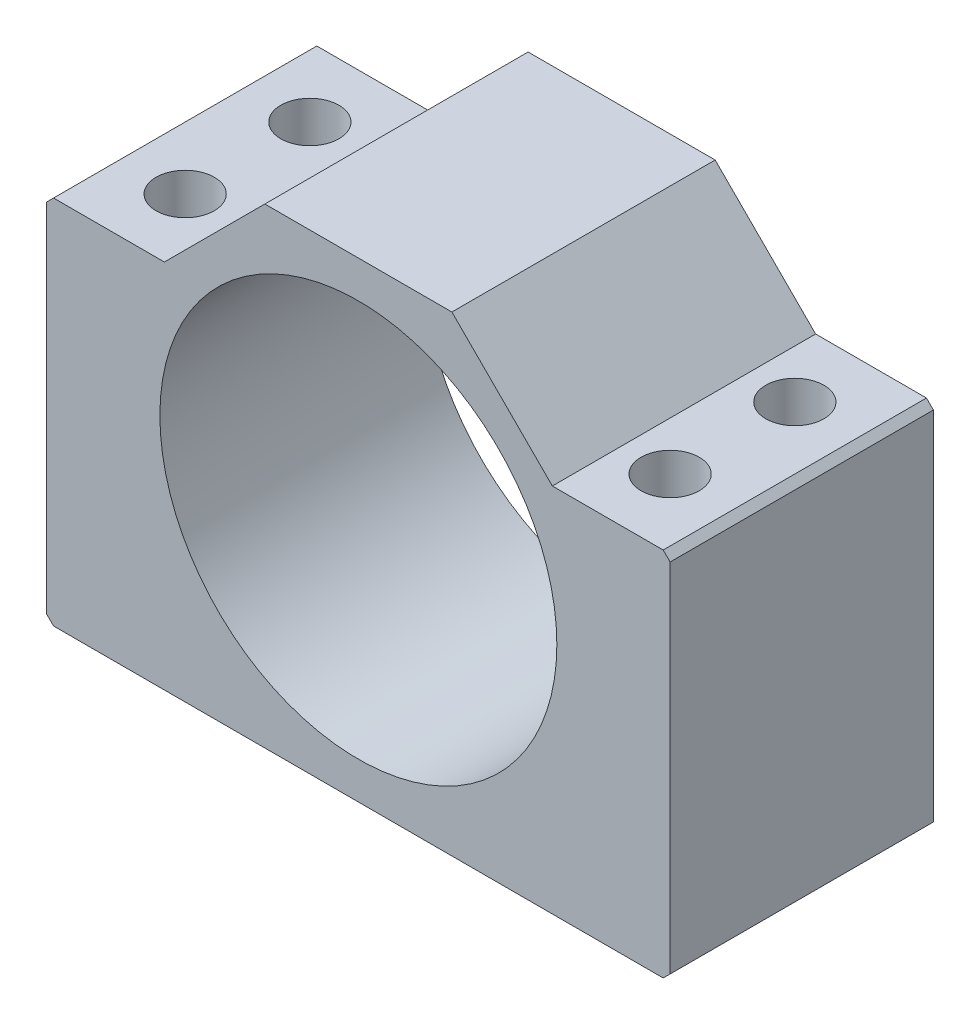
ISO-10303-21;
HEADER;
FILE_DESCRIPTION(('STEP AP214'),'2;1');
FILE_NAME('part.step','',(''),(''),'','','');
FILE_SCHEMA(('AUTOMOTIVE_DESIGN { 1 0 10303 214 1 1 1 1 }'));
ENDSEC;
DATA;
#1=APPLICATION_CONTEXT('core data for automotive mechanical design processes');
#2=APPLICATION_PROTOCOL_DEFINITION('international standard','automotive_design',2000,#1);
#3=PRODUCT_CONTEXT('',#1,'mechanical');
#4=PRODUCT('Part','Part','',(#3));
#5=PRODUCT_RELATED_PRODUCT_CATEGORY('part','',(#4));
#6=PRODUCT_DEFINITION_FORMATION('','',#4);
#7=PRODUCT_DEFINITION_CONTEXT('part definition',#1,'design');
#8=PRODUCT_DEFINITION('design','',#6,#7);
#9=PRODUCT_DEFINITION_SHAPE('','',#8);
#10=(LENGTH_UNIT() NAMED_UNIT(*) SI_UNIT(.MILLI.,.METRE.));
#11=(NAMED_UNIT(*) PLANE_ANGLE_UNIT() SI_UNIT($,.RADIAN.));
#12=(NAMED_UNIT(*) SI_UNIT($,.STERADIAN.) SOLID_ANGLE_UNIT());
#13=UNCERTAINTY_MEASURE_WITH_UNIT(LENGTH_MEASURE(1.E-05),#10,'distance_accuracy_value','');
#14=(GEOMETRIC_REPRESENTATION_CONTEXT(3) GLOBAL_UNCERTAINTY_ASSIGNED_CONTEXT((#13)) GLOBAL_UNIT_ASSIGNED_CONTEXT((#10,
#11,#12)) REPRESENTATION_CONTEXT('',''));
#15=CARTESIAN_POINT('',(0.,0.,0.));
#16=DIRECTION('',(0.,0.,1.));
#17=DIRECTION('',(1.,0.,0.));
#18=AXIS2_PLACEMENT_3D('',#15,#16,#17);
#19=CARTESIAN_POINT('',(0.,0.,19.));
#20=DIRECTION('',(0.,0.,-1.));
#21=DIRECTION('',(-1.,0.,0.));
#22=AXIS2_PLACEMENT_3D('',#19,#20,#21);
#23=PLANE('',#22);
#24=DIRECTION('',(1.,0.,0.));
#25=VECTOR('',#24,1.);
#26=CARTESIAN_POINT('',(-45.,-34.,19.));
#27=LINE('',#26,#25);
#28=CARTESIAN_POINT('',(-44.,-34.,19.));
#29=VERTEX_POINT('',#28);
#30=CARTESIAN_POINT('',(44.,-34.,19.));
#31=VERTEX_POINT('',#30);
#32=EDGE_CURVE('E203',#29,#31,#27,.T.);
#33=ORIENTED_EDGE('',*,*,#32,.T.);
#34=DIRECTION('',(-0.707106781186548,-0.707106781186548,0.));
#35=VECTOR('',#34,1.);
#36=CARTESIAN_POINT('',(45.,-33.,19.));
#37=LINE('',#36,#35);
#38=CARTESIAN_POINT('',(45.,-33.,19.));
#39=VERTEX_POINT('',#38);
#40=EDGE_CURVE('E241',#31,#39,#37,.F.);
#41=ORIENTED_EDGE('',*,*,#40,.T.);
#42=DIRECTION('',(0.,1.,0.));
#43=VECTOR('',#42,1.);
#44=CARTESIAN_POINT('',(45.,-34.,19.));
#45=LINE('',#44,#43);
#46=CARTESIAN_POINT('',(45.,18.5,19.));
#47=VERTEX_POINT('',#46);
#48=EDGE_CURVE('E195',#39,#47,#45,.T.);
#49=ORIENTED_EDGE('',*,*,#48,.T.);
#50=DIRECTION('',(0.707106781186548,-0.707106781186548,0.));
#51=VECTOR('',#50,1.);
#52=CARTESIAN_POINT('',(45.,18.5,19.));
#53=LINE('',#52,#51);
#54=CARTESIAN_POINT('',(44.,19.5,19.));
#55=VERTEX_POINT('',#54);
#56=EDGE_CURVE('E236',#47,#55,#53,.F.);
#57=ORIENTED_EDGE('',*,*,#56,.T.);
#58=DIRECTION('',(1.,0.,0.));
#59=VECTOR('',#58,1.);
#60=CARTESIAN_POINT('',(45.,19.5,19.));
#61=LINE('',#60,#59);
#62=CARTESIAN_POINT('',(28.0000000000004,19.5,19.));
#63=VERTEX_POINT('',#62);
#64=EDGE_CURVE('E148',#63,#55,#61,.T.);
#65=ORIENTED_EDGE('',*,*,#64,.F.);
#66=DIRECTION('',(0.707106781186556,-0.707106781186538,0.));
#67=VECTOR('',#66,1.);
#68=CARTESIAN_POINT('',(28.0000000000004,19.5,19.));
#69=LINE('',#68,#67);
#70=CARTESIAN_POINT('',(13.5,34.,19.));
#71=VERTEX_POINT('',#70);
#72=EDGE_CURVE('E127',#71,#63,#69,.T.);
#73=ORIENTED_EDGE('',*,*,#72,.F.);
#74=DIRECTION('',(-1.,0.,0.));
#75=VECTOR('',#74,1.);
#76=CARTESIAN_POINT('',(-45.,34.,19.));
#77=LINE('',#76,#75);
#78=CARTESIAN_POINT('',(-13.5,34.,19.));
#79=VERTEX_POINT('',#78);
#80=EDGE_CURVE('E198',#71,#79,#77,.T.);
#81=ORIENTED_EDGE('',*,*,#80,.T.);
#82=DIRECTION('',(0.707106781186546,0.707106781186549,0.));
#83=VECTOR('',#82,1.);
#84=CARTESIAN_POINT('',(-28.,19.5,19.));
#85=LINE('',#84,#83);
#86=CARTESIAN_POINT('',(-28.,19.5,19.));
#87=VERTEX_POINT('',#86);
#88=EDGE_CURVE('E161',#87,#79,#85,.T.);
#89=ORIENTED_EDGE('',*,*,#88,.F.);
#90=DIRECTION('',(1.,0.,0.));
#91=VECTOR('',#90,1.);
#92=CARTESIAN_POINT('',(-45.,19.5,19.));
#93=LINE('',#92,#91);
#94=CARTESIAN_POINT('',(-44.,19.5,19.));
#95=VERTEX_POINT('',#94);
#96=EDGE_CURVE('E157',#95,#87,#93,.T.);
#97=ORIENTED_EDGE('',*,*,#96,.F.);
#98=DIRECTION('',(0.707106781186548,0.707106781186548,0.));
#99=VECTOR('',#98,1.);
#100=CARTESIAN_POINT('',(-44.,19.5,19.));
#101=LINE('',#100,#99);
#102=CARTESIAN_POINT('',(-45.,18.5,19.));
#103=VERTEX_POINT('',#102);
#104=EDGE_CURVE('E54',#95,#103,#101,.F.);
#105=ORIENTED_EDGE('',*,*,#104,.T.);
#106=DIRECTION('',(0.,-1.,0.));
#107=VECTOR('',#106,1.);
#108=CARTESIAN_POINT('',(-45.,-34.,19.));
#109=LINE('',#108,#107);
#110=CARTESIAN_POINT('',(-45.,-33.,19.));
#111=VERTEX_POINT('',#110);
#112=EDGE_CURVE('E201',#103,#111,#109,.T.);
#113=ORIENTED_EDGE('',*,*,#112,.T.);
#114=DIRECTION('',(-0.707106781186548,0.707106781186548,0.));
#115=VECTOR('',#114,1.);
#116=CARTESIAN_POINT('',(-44.,-34.,19.));
#117=LINE('',#116,#115);
#118=EDGE_CURVE('E239',#111,#29,#117,.F.);
#119=ORIENTED_EDGE('',*,*,#118,.T.);
#120=EDGE_LOOP('',(#33,#41,#49,#57,#65,#73,#81,#89,#97,#105,#113,#119));
#121=FACE_BOUND('',#120,.T.);
#122=CARTESIAN_POINT('',(0.,0.,19.));
#123=DIRECTION('',(0.,0.,1.));
#124=DIRECTION('',(1.,0.,0.));
#125=AXIS2_PLACEMENT_3D('',#122,#123,#124);
#126=CIRCLE('',#125,28.65);
#127=CARTESIAN_POINT('',(28.65,0.,19.));
#128=VERTEX_POINT('',#127);
#129=EDGE_CURVE('E189',#128,#128,#126,.T.);
#130=ORIENTED_EDGE('',*,*,#129,.F.);
#131=EDGE_LOOP('',(#130));
#132=FACE_BOUND('',#131,.T.);
#133=ADVANCED_FACE('F32',(#121,#132),#23,.F.);
#134=CARTESIAN_POINT('',(0.,0.,-19.));
#135=DIRECTION('',(0.,0.,-1.));
#136=DIRECTION('',(-1.,0.,0.));
#137=AXIS2_PLACEMENT_3D('',#134,#135,#136);
#138=PLANE('',#137);
#139=DIRECTION('',(0.,1.,0.));
#140=VECTOR('',#139,1.);
#141=CARTESIAN_POINT('',(45.,-34.,-19.));
#142=LINE('',#141,#140);
#143=CARTESIAN_POINT('',(45.,-33.,-19.));
#144=VERTEX_POINT('',#143);
#145=CARTESIAN_POINT('',(45.,18.5,-19.));
#146=VERTEX_POINT('',#145);
#147=EDGE_CURVE('E192',#144,#146,#142,.T.);
#148=ORIENTED_EDGE('',*,*,#147,.F.);
#149=DIRECTION('',(0.707106781186548,0.707106781186548,0.));
#150=VECTOR('',#149,1.);
#151=CARTESIAN_POINT('',(39.,-39.,-19.));
#152=LINE('',#151,#150);
#153=CARTESIAN_POINT('',(44.,-34.,-19.));
#154=VERTEX_POINT('',#153);
#155=EDGE_CURVE('E229',#144,#154,#152,.F.);
#156=ORIENTED_EDGE('',*,*,#155,.T.);
#157=DIRECTION('',(1.,0.,0.));
#158=VECTOR('',#157,1.);
#159=CARTESIAN_POINT('',(-45.,-34.,-19.));
#160=LINE('',#159,#158);
#161=CARTESIAN_POINT('',(-44.,-34.,-19.));
#162=VERTEX_POINT('',#161);
#163=EDGE_CURVE('E199',#162,#154,#160,.T.);
#164=ORIENTED_EDGE('',*,*,#163,.F.);
#165=DIRECTION('',(0.707106781186548,-0.707106781186548,0.));
#166=VECTOR('',#165,1.);
#167=CARTESIAN_POINT('',(-39.,-39.,-19.));
#168=LINE('',#167,#166);
#169=CARTESIAN_POINT('',(-45.,-33.,-19.));
#170=VERTEX_POINT('',#169);
#171=EDGE_CURVE('E227',#162,#170,#168,.F.);
#172=ORIENTED_EDGE('',*,*,#171,.T.);
#173=DIRECTION('',(0.,-1.,0.));
#174=VECTOR('',#173,1.);
#175=CARTESIAN_POINT('',(-45.,-34.,-19.));
#176=LINE('',#175,#174);
#177=CARTESIAN_POINT('',(-45.,18.5,-19.));
#178=VERTEX_POINT('',#177);
#179=EDGE_CURVE('E210',#178,#170,#176,.T.);
#180=ORIENTED_EDGE('',*,*,#179,.F.);
#181=DIRECTION('',(-0.707106781186548,-0.707106781186548,0.));
#182=VECTOR('',#181,1.);
#183=CARTESIAN_POINT('',(-31.75,31.75,-19.));
#184=LINE('',#183,#182);
#185=CARTESIAN_POINT('',(-44.,19.5,-19.));
#186=VERTEX_POINT('',#185);
#187=EDGE_CURVE('E225',#178,#186,#184,.F.);
#188=ORIENTED_EDGE('',*,*,#187,.T.);
#189=DIRECTION('',(1.,0.,0.));
#190=VECTOR('',#189,1.);
#191=CARTESIAN_POINT('',(-45.,19.5,-19.));
#192=LINE('',#191,#190);
#193=CARTESIAN_POINT('',(-28.,19.5,-19.));
#194=VERTEX_POINT('',#193);
#195=EDGE_CURVE('E158',#186,#194,#192,.T.);
#196=ORIENTED_EDGE('',*,*,#195,.T.);
#197=DIRECTION('',(0.707106781186546,0.707106781186549,0.));
#198=VECTOR('',#197,1.);
#199=CARTESIAN_POINT('',(-28.,19.5,-19.));
#200=LINE('',#199,#198);
#201=CARTESIAN_POINT('',(-13.5,34.,-19.));
#202=VERTEX_POINT('',#201);
#203=EDGE_CURVE('E160',#194,#202,#200,.T.);
#204=ORIENTED_EDGE('',*,*,#203,.T.);
#205=DIRECTION('',(-1.,0.,0.));
#206=VECTOR('',#205,1.);
#207=CARTESIAN_POINT('',(-45.,34.,-19.));
#208=LINE('',#207,#206);
#209=CARTESIAN_POINT('',(13.5,34.,-19.));
#210=VERTEX_POINT('',#209);
#211=EDGE_CURVE('E147',#210,#202,#208,.T.);
#212=ORIENTED_EDGE('',*,*,#211,.F.);
#213=DIRECTION('',(0.707106781186556,-0.707106781186538,0.));
#214=VECTOR('',#213,1.);
#215=CARTESIAN_POINT('',(28.0000000000004,19.5,-19.));
#216=LINE('',#215,#214);
#217=CARTESIAN_POINT('',(28.0000000000004,19.5,-19.));
#218=VERTEX_POINT('',#217);
#219=EDGE_CURVE('E124',#210,#218,#216,.T.);
#220=ORIENTED_EDGE('',*,*,#219,.T.);
#221=DIRECTION('',(1.,0.,0.));
#222=VECTOR('',#221,1.);
#223=CARTESIAN_POINT('',(45.,19.5,-19.));
#224=LINE('',#223,#222);
#225=CARTESIAN_POINT('',(44.,19.5,-19.));
#226=VERTEX_POINT('',#225);
#227=EDGE_CURVE('E135',#218,#226,#224,.T.);
#228=ORIENTED_EDGE('',*,*,#227,.T.);
#229=DIRECTION('',(-0.707106781186548,0.707106781186548,0.));
#230=VECTOR('',#229,1.);
#231=CARTESIAN_POINT('',(31.75,31.75,-19.));
#232=LINE('',#231,#230);
#233=EDGE_CURVE('E223',#226,#146,#232,.F.);
#234=ORIENTED_EDGE('',*,*,#233,.T.);
#235=EDGE_LOOP('',(#148,#156,#164,#172,#180,#188,#196,#204,#212,#220,#228,#234));
#236=FACE_BOUND('',#235,.T.);
#237=CARTESIAN_POINT('',(0.,0.,-19.));
#238=DIRECTION('',(0.,0.,1.));
#239=DIRECTION('',(1.,0.,0.));
#240=AXIS2_PLACEMENT_3D('',#237,#238,#239);
#241=CIRCLE('',#240,28.65);
#242=CARTESIAN_POINT('',(28.65,0.,-19.));
#243=VERTEX_POINT('',#242);
#244=EDGE_CURVE('E188',#243,#243,#241,.T.);
#245=ORIENTED_EDGE('',*,*,#244,.T.);
#246=EDGE_LOOP('',(#245));
#247=FACE_BOUND('',#246,.T.);
#248=ADVANCED_FACE('F144',(#236,#247),#138,.T.);
#249=CARTESIAN_POINT('',(45.,-34.,19.));
#250=DIRECTION('',(-1.,0.,0.));
#251=DIRECTION('',(0.,0.,1.));
#252=AXIS2_PLACEMENT_3D('',#249,#250,#251);
#253=PLANE('',#252);
#254=ORIENTED_EDGE('',*,*,#48,.F.);
#255=DIRECTION('',(0.,0.,-1.));
#256=VECTOR('',#255,1.);
#257=CARTESIAN_POINT('',(45.,-33.,19.));
#258=LINE('',#257,#256);
#259=EDGE_CURVE('E220',#39,#144,#258,.T.);
#260=ORIENTED_EDGE('',*,*,#259,.T.);
#261=ORIENTED_EDGE('',*,*,#147,.T.);
#262=DIRECTION('',(0.,0.,1.));
#263=VECTOR('',#262,1.);
#264=CARTESIAN_POINT('',(45.,18.5,19.));
#265=LINE('',#264,#263);
#266=EDGE_CURVE('E206',#146,#47,#265,.T.);
#267=ORIENTED_EDGE('',*,*,#266,.T.);
#268=EDGE_LOOP('',(#254,#260,#261,#267));
#269=FACE_BOUND('',#268,.T.);
#270=ADVANCED_FACE('F267',(#269),#253,.F.);
#271=CARTESIAN_POINT('',(-45.,34.,19.));
#272=DIRECTION('',(0.,-1.,0.));
#273=DIRECTION('',(0.,0.,-1.));
#274=AXIS2_PLACEMENT_3D('',#271,#272,#273);
#275=PLANE('',#274);
#276=ORIENTED_EDGE('',*,*,#80,.F.);
#277=DIRECTION('',(0.,0.,1.));
#278=VECTOR('',#277,1.);
#279=CARTESIAN_POINT('',(13.5,34.,-19.));
#280=LINE('',#279,#278);
#281=EDGE_CURVE('E132',#210,#71,#280,.T.);
#282=ORIENTED_EDGE('',*,*,#281,.F.);
#283=ORIENTED_EDGE('',*,*,#211,.T.);
#284=DIRECTION('',(0.,0.,1.));
#285=VECTOR('',#284,1.);
#286=CARTESIAN_POINT('',(-13.5,34.,-19.));
#287=LINE('',#286,#285);
#288=EDGE_CURVE('E167',#202,#79,#287,.T.);
#289=ORIENTED_EDGE('',*,*,#288,.T.);
#290=EDGE_LOOP('',(#276,#282,#283,#289));
#291=FACE_BOUND('',#290,.T.);
#292=ADVANCED_FACE('F262',(#291),#275,.F.);
#293=CARTESIAN_POINT('',(-45.,-34.,19.));
#294=DIRECTION('',(1.,0.,0.));
#295=DIRECTION('',(0.,0.,-1.));
#296=AXIS2_PLACEMENT_3D('',#293,#294,#295);
#297=PLANE('',#296);
#298=ORIENTED_EDGE('',*,*,#179,.T.);
#299=DIRECTION('',(0.,0.,1.));
#300=VECTOR('',#299,1.);
#301=CARTESIAN_POINT('',(-45.,-33.,19.));
#302=LINE('',#301,#300);
#303=EDGE_CURVE('E47',#170,#111,#302,.T.);
#304=ORIENTED_EDGE('',*,*,#303,.T.);
#305=ORIENTED_EDGE('',*,*,#112,.F.);
#306=DIRECTION('',(0.,0.,-1.));
#307=VECTOR('',#306,1.);
#308=CARTESIAN_POINT('',(-45.,18.5,19.));
#309=LINE('',#308,#307);
#310=EDGE_CURVE('E243',#103,#178,#309,.T.);
#311=ORIENTED_EDGE('',*,*,#310,.T.);
#312=EDGE_LOOP('',(#298,#304,#305,#311));
#313=FACE_BOUND('',#312,.T.);
#314=ADVANCED_FACE('F282',(#313),#297,.F.);
#315=CARTESIAN_POINT('',(-45.,-34.,19.));
#316=DIRECTION('',(0.,1.,0.));
#317=DIRECTION('',(0.,0.,1.));
#318=AXIS2_PLACEMENT_3D('',#315,#316,#317);
#319=PLANE('',#318);
#320=CARTESIAN_POINT('',(-35.,-34.,-9.));
#321=DIRECTION('',(0.,1.,0.));
#322=DIRECTION('',(0.,0.,1.));
#323=AXIS2_PLACEMENT_3D('',#320,#321,#322);
#324=CIRCLE('',#323,4.19999999999999);
#325=CARTESIAN_POINT('',(-35.,-34.,-4.80000000000001));
#326=VERTEX_POINT('',#325);
#327=EDGE_CURVE('E176',#326,#326,#324,.T.);
#328=ORIENTED_EDGE('',*,*,#327,.T.);
#329=EDGE_LOOP('',(#328));
#330=FACE_BOUND('',#329,.T.);
#331=CARTESIAN_POINT('',(-35.,-34.,9.));
#332=DIRECTION('',(0.,1.,0.));
#333=DIRECTION('',(0.,0.,1.));
#334=AXIS2_PLACEMENT_3D('',#331,#332,#333);
#335=CIRCLE('',#334,4.19999999999999);
#336=CARTESIAN_POINT('',(-35.,-34.,13.2));
#337=VERTEX_POINT('',#336);
#338=EDGE_CURVE('E179',#337,#337,#335,.T.);
#339=ORIENTED_EDGE('',*,*,#338,.T.);
#340=EDGE_LOOP('',(#339));
#341=FACE_BOUND('',#340,.T.);
#342=CARTESIAN_POINT('',(35.,-34.,9.));
#343=DIRECTION('',(0.,1.,0.));
#344=DIRECTION('',(0.,0.,1.));
#345=AXIS2_PLACEMENT_3D('',#342,#343,#344);
#346=CIRCLE('',#345,4.2);
#347=CARTESIAN_POINT('',(35.,-34.,13.2));
#348=VERTEX_POINT('',#347);
#349=EDGE_CURVE('E182',#348,#348,#346,.T.);
#350=ORIENTED_EDGE('',*,*,#349,.T.);
#351=EDGE_LOOP('',(#350));
#352=FACE_BOUND('',#351,.T.);
#353=CARTESIAN_POINT('',(35.,-34.,-9.));
#354=DIRECTION('',(0.,1.,0.));
#355=DIRECTION('',(0.,0.,1.));
#356=AXIS2_PLACEMENT_3D('',#353,#354,#355);
#357=CIRCLE('',#356,4.2);
#358=CARTESIAN_POINT('',(35.,-34.,-4.8));
#359=VERTEX_POINT('',#358);
#360=EDGE_CURVE('E185',#359,#359,#357,.T.);
#361=ORIENTED_EDGE('',*,*,#360,.T.);
#362=EDGE_LOOP('',(#361));
#363=FACE_BOUND('',#362,.T.);
#364=ORIENTED_EDGE('',*,*,#163,.T.);
#365=DIRECTION('',(0.,0.,1.));
#366=VECTOR('',#365,1.);
#367=CARTESIAN_POINT('',(44.,-34.,19.));
#368=LINE('',#367,#366);
#369=EDGE_CURVE('E234',#154,#31,#368,.T.);
#370=ORIENTED_EDGE('',*,*,#369,.T.);
#371=ORIENTED_EDGE('',*,*,#32,.F.);
#372=DIRECTION('',(0.,0.,-1.));
#373=VECTOR('',#372,1.);
#374=CARTESIAN_POINT('',(-44.,-34.,19.));
#375=LINE('',#374,#373);
#376=EDGE_CURVE('E231',#29,#162,#375,.T.);
#377=ORIENTED_EDGE('',*,*,#376,.T.);
#378=EDGE_LOOP('',(#364,#370,#371,#377));
#379=FACE_BOUND('',#378,.T.);
#380=ADVANCED_FACE('F275',(#330,#341,#352,#363,#379),#319,.F.);
#381=CARTESIAN_POINT('',(0.,0.,19.));
#382=DIRECTION('',(0.,0.,-1.));
#383=DIRECTION('',(-1.,0.,0.));
#384=AXIS2_PLACEMENT_3D('',#381,#382,#383);
#385=CYLINDRICAL_SURFACE('',#384,28.65);
#386=ORIENTED_EDGE('',*,*,#129,.T.);
#387=EDGE_LOOP('',(#386));
#388=FACE_BOUND('',#387,.T.);
#389=ORIENTED_EDGE('',*,*,#244,.F.);
#390=EDGE_LOOP('',(#389));
#391=FACE_BOUND('',#390,.T.);
#392=ADVANCED_FACE('F298',(#388,#391),#385,.F.);
#393=CARTESIAN_POINT('',(35.,34.,-9.));
#394=DIRECTION('',(0.,1.,0.));
#395=DIRECTION('',(0.,0.,1.));
#396=AXIS2_PLACEMENT_3D('',#393,#394,#395);
#397=CYLINDRICAL_SURFACE('',#396,4.19999999999999);
#398=CARTESIAN_POINT('',(35.,19.5,-9.));
#399=DIRECTION('',(0.,-1.,0.));
#400=DIRECTION('',(1.,0.,0.));
#401=AXIS2_PLACEMENT_3D('',#398,#399,#400);
#402=CIRCLE('',#401,4.19999999999999);
#403=CARTESIAN_POINT('',(39.2,19.5,-9.));
#404=VERTEX_POINT('',#403);
#405=EDGE_CURVE('E154',#404,#404,#402,.F.);
#406=ORIENTED_EDGE('',*,*,#405,.T.);
#407=EDGE_LOOP('',(#406));
#408=FACE_BOUND('',#407,.T.);
#409=ORIENTED_EDGE('',*,*,#360,.F.);
#410=EDGE_LOOP('',(#409));
#411=FACE_BOUND('',#410,.T.);
#412=ADVANCED_FACE('F336',(#408,#411),#397,.F.);
#413=CARTESIAN_POINT('',(35.,34.,9.));
#414=DIRECTION('',(0.,1.,0.));
#415=DIRECTION('',(0.,0.,1.));
#416=AXIS2_PLACEMENT_3D('',#413,#414,#415);
#417=CYLINDRICAL_SURFACE('',#416,4.19999999999999);
#418=CARTESIAN_POINT('',(35.,19.5,9.));
#419=DIRECTION('',(0.,-1.,0.));
#420=DIRECTION('',(1.,0.,0.));
#421=AXIS2_PLACEMENT_3D('',#418,#419,#420);
#422=CIRCLE('',#421,4.19999999999999);
#423=CARTESIAN_POINT('',(39.2,19.5,9.));
#424=VERTEX_POINT('',#423);
#425=EDGE_CURVE('E131',#424,#424,#422,.F.);
#426=ORIENTED_EDGE('',*,*,#425,.T.);
#427=EDGE_LOOP('',(#426));
#428=FACE_BOUND('',#427,.T.);
#429=ORIENTED_EDGE('',*,*,#349,.F.);
#430=EDGE_LOOP('',(#429));
#431=FACE_BOUND('',#430,.T.);
#432=ADVANCED_FACE('F333',(#428,#431),#417,.F.);
#433=CARTESIAN_POINT('',(-35.,34.,9.));
#434=DIRECTION('',(0.,1.,0.));
#435=DIRECTION('',(0.,0.,1.));
#436=AXIS2_PLACEMENT_3D('',#433,#434,#435);
#437=CYLINDRICAL_SURFACE('',#436,4.19999999999999);
#438=CARTESIAN_POINT('',(-35.,19.5,9.));
#439=DIRECTION('',(0.,-1.,0.));
#440=DIRECTION('',(1.,0.,0.));
#441=AXIS2_PLACEMENT_3D('',#438,#439,#440);
#442=CIRCLE('',#441,4.19999999999999);
#443=CARTESIAN_POINT('',(-30.8,19.5,9.));
#444=VERTEX_POINT('',#443);
#445=EDGE_CURVE('E173',#444,#444,#442,.F.);
#446=ORIENTED_EDGE('',*,*,#445,.T.);
#447=EDGE_LOOP('',(#446));
#448=FACE_BOUND('',#447,.T.);
#449=ORIENTED_EDGE('',*,*,#338,.F.);
#450=EDGE_LOOP('',(#449));
#451=FACE_BOUND('',#450,.T.);
#452=ADVANCED_FACE('F329',(#448,#451),#437,.F.);
#453=CARTESIAN_POINT('',(-35.,34.,-9.));
#454=DIRECTION('',(0.,1.,0.));
#455=DIRECTION('',(0.,0.,1.));
#456=AXIS2_PLACEMENT_3D('',#453,#454,#455);
#457=CYLINDRICAL_SURFACE('',#456,4.19999999999999);
#458=CARTESIAN_POINT('',(-35.,19.5,-9.));
#459=DIRECTION('',(0.,-1.,0.));
#460=DIRECTION('',(1.,0.,0.));
#461=AXIS2_PLACEMENT_3D('',#458,#459,#460);
#462=CIRCLE('',#461,4.19999999999999);
#463=CARTESIAN_POINT('',(-30.8,19.5,-9.));
#464=VERTEX_POINT('',#463);
#465=EDGE_CURVE('E170',#464,#464,#462,.F.);
#466=ORIENTED_EDGE('',*,*,#465,.T.);
#467=EDGE_LOOP('',(#466));
#468=FACE_BOUND('',#467,.T.);
#469=ORIENTED_EDGE('',*,*,#327,.F.);
#470=EDGE_LOOP('',(#469));
#471=FACE_BOUND('',#470,.T.);
#472=ADVANCED_FACE('F325',(#468,#471),#457,.F.);
#473=CARTESIAN_POINT('',(-45.,19.5,-19.));
#474=DIRECTION('',(0.,-1.,0.));
#475=DIRECTION('',(1.,0.,0.));
#476=AXIS2_PLACEMENT_3D('',#473,#474,#475);
#477=PLANE('',#476);
#478=ORIENTED_EDGE('',*,*,#465,.F.);
#479=EDGE_LOOP('',(#478));
#480=FACE_BOUND('',#479,.T.);
#481=ORIENTED_EDGE('',*,*,#195,.F.);
#482=DIRECTION('',(0.,0.,1.));
#483=VECTOR('',#482,1.);
#484=CARTESIAN_POINT('',(-44.,19.5,-19.));
#485=LINE('',#484,#483);
#486=EDGE_CURVE('E40',#186,#95,#485,.T.);
#487=ORIENTED_EDGE('',*,*,#486,.T.);
#488=ORIENTED_EDGE('',*,*,#96,.T.);
#489=DIRECTION('',(0.,0.,1.));
#490=VECTOR('',#489,1.);
#491=CARTESIAN_POINT('',(-28.,19.5,-19.));
#492=LINE('',#491,#490);
#493=EDGE_CURVE('E163',#194,#87,#492,.T.);
#494=ORIENTED_EDGE('',*,*,#493,.F.);
#495=EDGE_LOOP('',(#481,#487,#488,#494));
#496=FACE_BOUND('',#495,.T.);
#497=ORIENTED_EDGE('',*,*,#445,.F.);
#498=EDGE_LOOP('',(#497));
#499=FACE_BOUND('',#498,.T.);
#500=ADVANCED_FACE('F249',(#480,#496,#499),#477,.F.);
#501=CARTESIAN_POINT('',(-28.,19.5,-19.));
#502=DIRECTION('',(0.707106781186549,-0.707106781186546,0.));
#503=DIRECTION('',(0.707106781186546,0.707106781186549,0.));
#504=AXIS2_PLACEMENT_3D('',#501,#502,#503);
#505=PLANE('',#504);
#506=ORIENTED_EDGE('',*,*,#88,.T.);
#507=ORIENTED_EDGE('',*,*,#288,.F.);
#508=ORIENTED_EDGE('',*,*,#203,.F.);
#509=ORIENTED_EDGE('',*,*,#493,.T.);
#510=EDGE_LOOP('',(#506,#507,#508,#509));
#511=FACE_BOUND('',#510,.T.);
#512=ADVANCED_FACE('F259',(#511),#505,.F.);
#513=CARTESIAN_POINT('',(45.,19.5,-19.));
#514=DIRECTION('',(0.,-1.,0.));
#515=DIRECTION('',(1.,0.,0.));
#516=AXIS2_PLACEMENT_3D('',#513,#514,#515);
#517=PLANE('',#516);
#518=ORIENTED_EDGE('',*,*,#425,.F.);
#519=EDGE_LOOP('',(#518));
#520=FACE_BOUND('',#519,.T.);
#521=ORIENTED_EDGE('',*,*,#64,.T.);
#522=DIRECTION('',(0.,0.,-1.));
#523=VECTOR('',#522,1.);
#524=CARTESIAN_POINT('',(44.,19.5,-19.));
#525=LINE('',#524,#523);
#526=EDGE_CURVE('E11',#55,#226,#525,.T.);
#527=ORIENTED_EDGE('',*,*,#526,.T.);
#528=ORIENTED_EDGE('',*,*,#227,.F.);
#529=DIRECTION('',(0.,0.,1.));
#530=VECTOR('',#529,1.);
#531=CARTESIAN_POINT('',(28.0000000000004,19.5,-19.));
#532=LINE('',#531,#530);
#533=EDGE_CURVE('E120',#218,#63,#532,.T.);
#534=ORIENTED_EDGE('',*,*,#533,.T.);
#535=EDGE_LOOP('',(#521,#527,#528,#534));
#536=FACE_BOUND('',#535,.T.);
#537=ORIENTED_EDGE('',*,*,#405,.F.);
#538=EDGE_LOOP('',(#537));
#539=FACE_BOUND('',#538,.T.);
#540=ADVANCED_FACE('F136',(#520,#536,#539),#517,.F.);
#541=CARTESIAN_POINT('',(28.0000000000004,19.5,-19.));
#542=DIRECTION('',(-0.707106781186539,-0.707106781186557,0.));
#543=DIRECTION('',(0.707106781186557,-0.707106781186539,0.));
#544=AXIS2_PLACEMENT_3D('',#541,#542,#543);
#545=PLANE('',#544);
#546=ORIENTED_EDGE('',*,*,#72,.T.);
#547=ORIENTED_EDGE('',*,*,#533,.F.);
#548=ORIENTED_EDGE('',*,*,#219,.F.);
#549=ORIENTED_EDGE('',*,*,#281,.T.);
#550=EDGE_LOOP('',(#546,#547,#548,#549));
#551=FACE_BOUND('',#550,.T.);
#552=ADVANCED_FACE('F122',(#551),#545,.F.);
#553=CARTESIAN_POINT('',(45.,-33.,19.));
#554=DIRECTION('',(-0.707106781186547,0.707106781186547,0.));
#555=DIRECTION('',(0.,0.,-1.));
#556=AXIS2_PLACEMENT_3D('',#553,#554,#555);
#557=PLANE('',#556);
#558=ORIENTED_EDGE('',*,*,#40,.F.);
#559=ORIENTED_EDGE('',*,*,#369,.F.);
#560=ORIENTED_EDGE('',*,*,#155,.F.);
#561=ORIENTED_EDGE('',*,*,#259,.F.);
#562=EDGE_LOOP('',(#558,#559,#560,#561));
#563=FACE_BOUND('',#562,.T.);
#564=ADVANCED_FACE('F271',(#563),#557,.F.);
#565=CARTESIAN_POINT('',(-44.,-34.,19.));
#566=DIRECTION('',(0.707106781186547,0.707106781186547,0.));
#567=DIRECTION('',(0.,0.,-1.));
#568=AXIS2_PLACEMENT_3D('',#565,#566,#567);
#569=PLANE('',#568);
#570=ORIENTED_EDGE('',*,*,#118,.F.);
#571=ORIENTED_EDGE('',*,*,#303,.F.);
#572=ORIENTED_EDGE('',*,*,#171,.F.);
#573=ORIENTED_EDGE('',*,*,#376,.F.);
#574=EDGE_LOOP('',(#570,#571,#572,#573));
#575=FACE_BOUND('',#574,.T.);
#576=ADVANCED_FACE('F280',(#575),#569,.F.);
#577=CARTESIAN_POINT('',(-44.,19.5,-19.));
#578=DIRECTION('',(0.707106781186547,-0.707106781186547,0.));
#579=DIRECTION('',(0.,0.,1.));
#580=AXIS2_PLACEMENT_3D('',#577,#578,#579);
#581=PLANE('',#580);
#582=ORIENTED_EDGE('',*,*,#187,.F.);
#583=ORIENTED_EDGE('',*,*,#310,.F.);
#584=ORIENTED_EDGE('',*,*,#104,.F.);
#585=ORIENTED_EDGE('',*,*,#486,.F.);
#586=EDGE_LOOP('',(#582,#583,#584,#585));
#587=FACE_BOUND('',#586,.T.);
#588=ADVANCED_FACE('F284',(#587),#581,.F.);
#589=CARTESIAN_POINT('',(45.,18.5,19.));
#590=DIRECTION('',(-0.707106781186547,-0.707106781186547,0.));
#591=DIRECTION('',(0.,0.,1.));
#592=AXIS2_PLACEMENT_3D('',#589,#590,#591);
#593=PLANE('',#592);
#594=ORIENTED_EDGE('',*,*,#233,.F.);
#595=ORIENTED_EDGE('',*,*,#526,.F.);
#596=ORIENTED_EDGE('',*,*,#56,.F.);
#597=ORIENTED_EDGE('',*,*,#266,.F.);
#598=EDGE_LOOP('',(#594,#595,#596,#597));
#599=FACE_BOUND('',#598,.T.);
#600=ADVANCED_FACE('F34',(#599),#593,.F.);
#601=CLOSED_SHELL('',(#133,#248,#270,#292,#314,#380,#392,#412,#432,#452,#472,#500,#512,#540,
#552,#564,#576,#588,#600));
#602=MANIFOLD_SOLID_BREP('B2',#601);
#603=ADVANCED_BREP_SHAPE_REPRESENTATION('',(#18,#602),#14);
#604=SHAPE_DEFINITION_REPRESENTATION(#9,#603);
ENDSEC;
END-ISO-10303-21;
